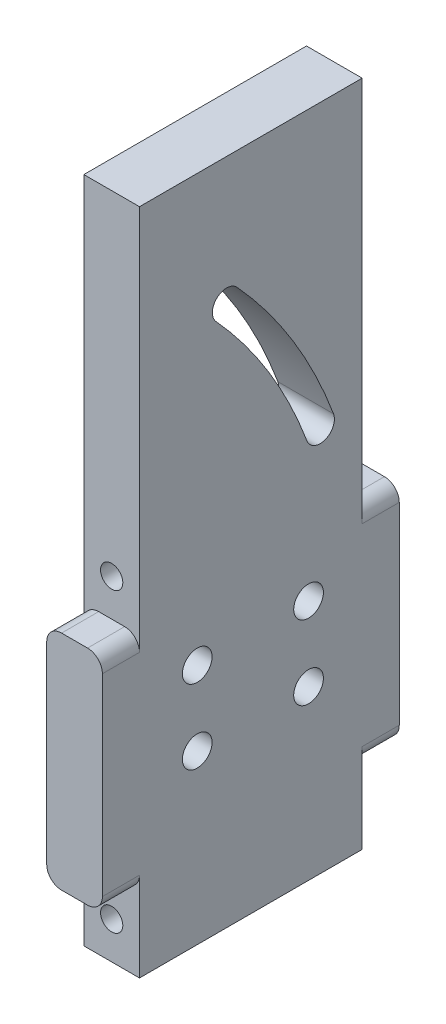
ISO-10303-21;
HEADER;
FILE_DESCRIPTION(('STEP AP214'),'2;1');
FILE_NAME('part.step','',(''),(''),'','','');
FILE_SCHEMA(('AUTOMOTIVE_DESIGN { 1 0 10303 214 1 1 1 1 }'));
ENDSEC;
DATA;
#1=APPLICATION_CONTEXT('core data for automotive mechanical design processes');
#2=APPLICATION_PROTOCOL_DEFINITION('international standard','automotive_design',2000,#1);
#3=PRODUCT_CONTEXT('',#1,'mechanical');
#4=PRODUCT('Part','Part','',(#3));
#5=PRODUCT_RELATED_PRODUCT_CATEGORY('part','',(#4));
#6=PRODUCT_DEFINITION_FORMATION('','',#4);
#7=PRODUCT_DEFINITION_CONTEXT('part definition',#1,'design');
#8=PRODUCT_DEFINITION('design','',#6,#7);
#9=PRODUCT_DEFINITION_SHAPE('','',#8);
#10=(LENGTH_UNIT() NAMED_UNIT(*) SI_UNIT(.MILLI.,.METRE.));
#11=(NAMED_UNIT(*) PLANE_ANGLE_UNIT() SI_UNIT($,.RADIAN.));
#12=(NAMED_UNIT(*) SI_UNIT($,.STERADIAN.) SOLID_ANGLE_UNIT());
#13=UNCERTAINTY_MEASURE_WITH_UNIT(LENGTH_MEASURE(1.E-05),#10,'distance_accuracy_value','');
#14=(GEOMETRIC_REPRESENTATION_CONTEXT(3) GLOBAL_UNCERTAINTY_ASSIGNED_CONTEXT((#13)) GLOBAL_UNIT_ASSIGNED_CONTEXT((#10,
#11,#12)) REPRESENTATION_CONTEXT('',''));
#15=CARTESIAN_POINT('',(0.,0.,0.));
#16=DIRECTION('',(0.,0.,1.));
#17=DIRECTION('',(1.,0.,0.));
#18=AXIS2_PLACEMENT_3D('',#15,#16,#17);
#19=CARTESIAN_POINT('',(19.05,0.,-76.2));
#20=DIRECTION('',(0.,1.,0.));
#21=DIRECTION('',(0.,0.,1.));
#22=AXIS2_PLACEMENT_3D('',#19,#20,#21);
#23=PLANE('',#22);
#24=DIRECTION('',(0.,0.,-1.));
#25=VECTOR('',#24,1.);
#26=CARTESIAN_POINT('',(0.,0.,-76.2));
#27=LINE('',#26,#25);
#28=CARTESIAN_POINT('',(0.,0.,0.));
#29=VERTEX_POINT('',#28);
#30=CARTESIAN_POINT('',(0.,0.,-76.2));
#31=VERTEX_POINT('',#30);
#32=EDGE_CURVE('E272',#29,#31,#27,.T.);
#33=ORIENTED_EDGE('',*,*,#32,.T.);
#34=DIRECTION('',(-1.,0.,0.));
#35=VECTOR('',#34,1.);
#36=CARTESIAN_POINT('',(19.05,0.,-76.2));
#37=LINE('',#36,#35);
#38=CARTESIAN_POINT('',(19.05,0.,-76.2));
#39=VERTEX_POINT('',#38);
#40=EDGE_CURVE('E342',#39,#31,#37,.T.);
#41=ORIENTED_EDGE('',*,*,#40,.F.);
#42=DIRECTION('',(0.,0.,-1.));
#43=VECTOR('',#42,1.);
#44=CARTESIAN_POINT('',(19.05,0.,-76.2));
#45=LINE('',#44,#43);
#46=CARTESIAN_POINT('',(19.05,0.,0.));
#47=VERTEX_POINT('',#46);
#48=EDGE_CURVE('E273',#47,#39,#45,.T.);
#49=ORIENTED_EDGE('',*,*,#48,.F.);
#50=DIRECTION('',(-1.,0.,0.));
#51=VECTOR('',#50,1.);
#52=CARTESIAN_POINT('',(19.05,0.,0.));
#53=LINE('',#52,#51);
#54=EDGE_CURVE('E293',#47,#29,#53,.T.);
#55=ORIENTED_EDGE('',*,*,#54,.T.);
#56=EDGE_LOOP('',(#33,#41,#49,#55));
#57=FACE_BOUND('',#56,.T.);
#58=ADVANCED_FACE('F32',(#57),#23,.F.);
#59=CARTESIAN_POINT('',(19.05,25.4,-76.2));
#60=DIRECTION('',(0.,0.,1.));
#61=DIRECTION('',(0.,-1.,0.));
#62=AXIS2_PLACEMENT_3D('',#59,#60,#61);
#63=PLANE('',#62);
#64=CARTESIAN_POINT('',(9.525,12.7,-76.2));
#65=DIRECTION('',(0.,0.,1.));
#66=DIRECTION('',(0.,-1.,0.));
#67=AXIS2_PLACEMENT_3D('',#64,#65,#66);
#68=CIRCLE('',#67,3.81);
#69=CARTESIAN_POINT('',(9.525,8.89,-76.2));
#70=VERTEX_POINT('',#69);
#71=EDGE_CURVE('E263',#70,#70,#68,.T.);
#72=ORIENTED_EDGE('',*,*,#71,.T.);
#73=EDGE_LOOP('',(#72));
#74=FACE_BOUND('',#73,.T.);
#75=DIRECTION('',(0.,1.,0.));
#76=VECTOR('',#75,1.);
#77=CARTESIAN_POINT('',(0.,25.4,-76.2));
#78=LINE('',#77,#76);
#79=CARTESIAN_POINT('',(0.,30.48,-76.2));
#80=VERTEX_POINT('',#79);
#81=EDGE_CURVE('E296',#31,#80,#78,.T.);
#82=ORIENTED_EDGE('',*,*,#81,.T.);
#83=CARTESIAN_POINT('',(5.08,30.48,-76.2));
#84=DIRECTION('',(0.,0.,1.));
#85=DIRECTION('',(0.,-1.,0.));
#86=AXIS2_PLACEMENT_3D('',#83,#84,#85);
#87=CIRCLE('',#86,5.08);
#88=CARTESIAN_POINT('',(5.08,25.4,-76.2));
#89=VERTEX_POINT('',#88);
#90=EDGE_CURVE('E410',#80,#89,#87,.T.);
#91=ORIENTED_EDGE('',*,*,#90,.T.);
#92=DIRECTION('',(-1.,0.,0.));
#93=VECTOR('',#92,1.);
#94=CARTESIAN_POINT('',(19.05,25.4,-76.2));
#95=LINE('',#94,#93);
#96=CARTESIAN_POINT('',(13.97,25.4,-76.2));
#97=VERTEX_POINT('',#96);
#98=EDGE_CURVE('E339',#97,#89,#95,.T.);
#99=ORIENTED_EDGE('',*,*,#98,.F.);
#100=CARTESIAN_POINT('',(13.97,30.48,-76.2));
#101=DIRECTION('',(0.,0.,1.));
#102=DIRECTION('',(0.,-1.,0.));
#103=AXIS2_PLACEMENT_3D('',#100,#101,#102);
#104=CIRCLE('',#103,5.08);
#105=CARTESIAN_POINT('',(19.05,30.48,-76.2));
#106=VERTEX_POINT('',#105);
#107=EDGE_CURVE('E402',#97,#106,#104,.T.);
#108=ORIENTED_EDGE('',*,*,#107,.T.);
#109=DIRECTION('',(0.,1.,0.));
#110=VECTOR('',#109,1.);
#111=CARTESIAN_POINT('',(19.05,25.4,-76.2));
#112=LINE('',#111,#110);
#113=EDGE_CURVE('E276',#39,#106,#112,.T.);
#114=ORIENTED_EDGE('',*,*,#113,.F.);
#115=ORIENTED_EDGE('',*,*,#40,.T.);
#116=EDGE_LOOP('',(#82,#91,#99,#108,#114,#115));
#117=FACE_BOUND('',#116,.T.);
#118=ADVANCED_FACE('F459',(#74,#117),#63,.F.);
#119=CARTESIAN_POINT('',(19.05,25.4,-88.9));
#120=DIRECTION('',(0.,1.,0.));
#121=DIRECTION('',(0.,0.,1.));
#122=AXIS2_PLACEMENT_3D('',#119,#120,#121);
#123=PLANE('',#122);
#124=DIRECTION('',(-1.,0.,0.));
#125=VECTOR('',#124,1.);
#126=CARTESIAN_POINT('',(19.05,25.4,-88.9));
#127=LINE('',#126,#125);
#128=CARTESIAN_POINT('',(13.97,25.4,-88.9));
#129=VERTEX_POINT('',#128);
#130=CARTESIAN_POINT('',(5.08,25.4,-88.9));
#131=VERTEX_POINT('',#130);
#132=EDGE_CURVE('E336',#129,#131,#127,.T.);
#133=ORIENTED_EDGE('',*,*,#132,.F.);
#134=DIRECTION('',(0.,0.,-1.));
#135=VECTOR('',#134,1.);
#136=CARTESIAN_POINT('',(13.97,25.4,-88.9));
#137=LINE('',#136,#135);
#138=EDGE_CURVE('E368',#129,#97,#137,.F.);
#139=ORIENTED_EDGE('',*,*,#138,.T.);
#140=ORIENTED_EDGE('',*,*,#98,.T.);
#141=DIRECTION('',(0.,0.,-1.));
#142=VECTOR('',#141,1.);
#143=CARTESIAN_POINT('',(5.08,25.4,-88.9));
#144=LINE('',#143,#142);
#145=EDGE_CURVE('E365',#89,#131,#144,.T.);
#146=ORIENTED_EDGE('',*,*,#145,.T.);
#147=EDGE_LOOP('',(#133,#139,#140,#146));
#148=FACE_BOUND('',#147,.T.);
#149=ADVANCED_FACE('F499',(#148),#123,.F.);
#150=CARTESIAN_POINT('',(19.05,101.6,-88.9));
#151=DIRECTION('',(0.,0.,1.));
#152=DIRECTION('',(0.,-1.,0.));
#153=AXIS2_PLACEMENT_3D('',#150,#151,#152);
#154=PLANE('',#153);
#155=DIRECTION('',(0.,1.,0.));
#156=VECTOR('',#155,1.);
#157=CARTESIAN_POINT('',(19.05,101.6,-88.9));
#158=LINE('',#157,#156);
#159=CARTESIAN_POINT('',(19.05,30.48,-88.9));
#160=VERTEX_POINT('',#159);
#161=CARTESIAN_POINT('',(19.05,96.52,-88.9));
#162=VERTEX_POINT('',#161);
#163=EDGE_CURVE('E279',#160,#162,#158,.T.);
#164=ORIENTED_EDGE('',*,*,#163,.F.);
#165=CARTESIAN_POINT('',(13.97,30.48,-88.9));
#166=DIRECTION('',(0.,0.,1.));
#167=DIRECTION('',(0.,-1.,0.));
#168=AXIS2_PLACEMENT_3D('',#165,#166,#167);
#169=CIRCLE('',#168,5.08);
#170=EDGE_CURVE('E363',#160,#129,#169,.F.);
#171=ORIENTED_EDGE('',*,*,#170,.T.);
#172=ORIENTED_EDGE('',*,*,#132,.T.);
#173=CARTESIAN_POINT('',(5.08,30.48,-88.9));
#174=DIRECTION('',(0.,0.,1.));
#175=DIRECTION('',(0.,-1.,0.));
#176=AXIS2_PLACEMENT_3D('',#173,#174,#175);
#177=CIRCLE('',#176,5.08);
#178=CARTESIAN_POINT('',(0.,30.48,-88.9));
#179=VERTEX_POINT('',#178);
#180=EDGE_CURVE('E357',#131,#179,#177,.F.);
#181=ORIENTED_EDGE('',*,*,#180,.T.);
#182=DIRECTION('',(0.,1.,0.));
#183=VECTOR('',#182,1.);
#184=CARTESIAN_POINT('',(0.,101.6,-88.9));
#185=LINE('',#184,#183);
#186=CARTESIAN_POINT('',(0.,96.52,-88.9));
#187=VERTEX_POINT('',#186);
#188=EDGE_CURVE('E298',#179,#187,#185,.T.);
#189=ORIENTED_EDGE('',*,*,#188,.T.);
#190=CARTESIAN_POINT('',(5.08,96.52,-88.9));
#191=DIRECTION('',(0.,0.,1.));
#192=DIRECTION('',(0.,-1.,0.));
#193=AXIS2_PLACEMENT_3D('',#190,#191,#192);
#194=CIRCLE('',#193,5.08);
#195=CARTESIAN_POINT('',(5.08,101.6,-88.9));
#196=VERTEX_POINT('',#195);
#197=EDGE_CURVE('E359',#187,#196,#194,.F.);
#198=ORIENTED_EDGE('',*,*,#197,.T.);
#199=DIRECTION('',(-1.,0.,0.));
#200=VECTOR('',#199,1.);
#201=CARTESIAN_POINT('',(19.05,101.6,-88.9));
#202=LINE('',#201,#200);
#203=CARTESIAN_POINT('',(13.97,101.6,-88.9));
#204=VERTEX_POINT('',#203);
#205=EDGE_CURVE('E333',#204,#196,#202,.T.);
#206=ORIENTED_EDGE('',*,*,#205,.F.);
#207=CARTESIAN_POINT('',(13.97,96.52,-88.9));
#208=DIRECTION('',(0.,0.,1.));
#209=DIRECTION('',(0.,-1.,0.));
#210=AXIS2_PLACEMENT_3D('',#207,#208,#209);
#211=CIRCLE('',#210,5.08);
#212=EDGE_CURVE('E361',#204,#162,#211,.F.);
#213=ORIENTED_EDGE('',*,*,#212,.T.);
#214=EDGE_LOOP('',(#164,#171,#172,#181,#189,#198,#206,#213));
#215=FACE_BOUND('',#214,.T.);
#216=ADVANCED_FACE('F467',(#215),#154,.F.);
#217=CARTESIAN_POINT('',(19.05,101.6,-76.2));
#218=DIRECTION('',(0.,-1.,0.));
#219=DIRECTION('',(0.,0.,-1.));
#220=AXIS2_PLACEMENT_3D('',#217,#218,#219);
#221=PLANE('',#220);
#222=DIRECTION('',(-1.,0.,0.));
#223=VECTOR('',#222,1.);
#224=CARTESIAN_POINT('',(19.05,101.6,-76.2));
#225=LINE('',#224,#223);
#226=CARTESIAN_POINT('',(13.97,101.6,-76.2));
#227=VERTEX_POINT('',#226);
#228=CARTESIAN_POINT('',(5.08,101.6,-76.2));
#229=VERTEX_POINT('',#228);
#230=EDGE_CURVE('E330',#227,#229,#225,.T.);
#231=ORIENTED_EDGE('',*,*,#230,.F.);
#232=DIRECTION('',(0.,0.,1.));
#233=VECTOR('',#232,1.);
#234=CARTESIAN_POINT('',(13.97,101.6,-76.2));
#235=LINE('',#234,#233);
#236=EDGE_CURVE('E373',#227,#204,#235,.F.);
#237=ORIENTED_EDGE('',*,*,#236,.T.);
#238=ORIENTED_EDGE('',*,*,#205,.T.);
#239=DIRECTION('',(0.,0.,1.));
#240=VECTOR('',#239,1.);
#241=CARTESIAN_POINT('',(5.08,101.6,-76.2));
#242=LINE('',#241,#240);
#243=EDGE_CURVE('E370',#196,#229,#242,.T.);
#244=ORIENTED_EDGE('',*,*,#243,.T.);
#245=EDGE_LOOP('',(#231,#237,#238,#244));
#246=FACE_BOUND('',#245,.T.);
#247=ADVANCED_FACE('F633',(#246),#221,.F.);
#248=CARTESIAN_POINT('',(19.05,228.6,-76.2));
#249=DIRECTION('',(0.,0.,1.));
#250=DIRECTION('',(0.,-1.,0.));
#251=AXIS2_PLACEMENT_3D('',#248,#249,#250);
#252=PLANE('',#251);
#253=CARTESIAN_POINT('',(9.525,114.3,-76.2));
#254=DIRECTION('',(0.,0.,1.));
#255=DIRECTION('',(0.,-1.,0.));
#256=AXIS2_PLACEMENT_3D('',#253,#254,#255);
#257=CIRCLE('',#256,3.81);
#258=CARTESIAN_POINT('',(9.525,110.49,-76.2));
#259=VERTEX_POINT('',#258);
#260=EDGE_CURVE('E269',#259,#259,#257,.T.);
#261=ORIENTED_EDGE('',*,*,#260,.T.);
#262=EDGE_LOOP('',(#261));
#263=FACE_BOUND('',#262,.T.);
#264=DIRECTION('',(0.,1.,0.));
#265=VECTOR('',#264,1.);
#266=CARTESIAN_POINT('',(0.,228.6,-76.2));
#267=LINE('',#266,#265);
#268=CARTESIAN_POINT('',(0.,96.52,-76.2));
#269=VERTEX_POINT('',#268);
#270=CARTESIAN_POINT('',(0.,228.6,-76.2));
#271=VERTEX_POINT('',#270);
#272=EDGE_CURVE('E301',#269,#271,#267,.T.);
#273=ORIENTED_EDGE('',*,*,#272,.T.);
#274=DIRECTION('',(-1.,0.,0.));
#275=VECTOR('',#274,1.);
#276=CARTESIAN_POINT('',(19.05,228.6,-76.2));
#277=LINE('',#276,#275);
#278=CARTESIAN_POINT('',(19.05,228.6,-76.2));
#279=VERTEX_POINT('',#278);
#280=EDGE_CURVE('E327',#279,#271,#277,.T.);
#281=ORIENTED_EDGE('',*,*,#280,.F.);
#282=DIRECTION('',(0.,1.,0.));
#283=VECTOR('',#282,1.);
#284=CARTESIAN_POINT('',(19.05,228.6,-76.2));
#285=LINE('',#284,#283);
#286=CARTESIAN_POINT('',(19.05,96.52,-76.2));
#287=VERTEX_POINT('',#286);
#288=EDGE_CURVE('E282',#287,#279,#285,.T.);
#289=ORIENTED_EDGE('',*,*,#288,.F.);
#290=CARTESIAN_POINT('',(13.97,96.52,-76.2));
#291=DIRECTION('',(0.,0.,1.));
#292=DIRECTION('',(0.,-1.,0.));
#293=AXIS2_PLACEMENT_3D('',#290,#291,#292);
#294=CIRCLE('',#293,5.08);
#295=EDGE_CURVE('E405',#287,#227,#294,.T.);
#296=ORIENTED_EDGE('',*,*,#295,.T.);
#297=ORIENTED_EDGE('',*,*,#230,.T.);
#298=CARTESIAN_POINT('',(5.08,96.52,-76.2));
#299=DIRECTION('',(0.,0.,1.));
#300=DIRECTION('',(0.,-1.,0.));
#301=AXIS2_PLACEMENT_3D('',#298,#299,#300);
#302=CIRCLE('',#301,5.08);
#303=EDGE_CURVE('E407',#229,#269,#302,.T.);
#304=ORIENTED_EDGE('',*,*,#303,.T.);
#305=EDGE_LOOP('',(#273,#281,#289,#296,#297,#304));
#306=FACE_BOUND('',#305,.T.);
#307=ADVANCED_FACE('F479',(#263,#306),#252,.F.);
#308=CARTESIAN_POINT('',(19.05,228.6,0.));
#309=DIRECTION('',(0.,-1.,0.));
#310=DIRECTION('',(0.,0.,-1.));
#311=AXIS2_PLACEMENT_3D('',#308,#309,#310);
#312=PLANE('',#311);
#313=DIRECTION('',(0.,0.,1.));
#314=VECTOR('',#313,1.);
#315=CARTESIAN_POINT('',(0.,228.6,0.));
#316=LINE('',#315,#314);
#317=CARTESIAN_POINT('',(0.,228.6,0.));
#318=VERTEX_POINT('',#317);
#319=EDGE_CURVE('E303',#271,#318,#316,.T.);
#320=ORIENTED_EDGE('',*,*,#319,.T.);
#321=DIRECTION('',(-1.,0.,0.));
#322=VECTOR('',#321,1.);
#323=CARTESIAN_POINT('',(19.05,228.6,0.));
#324=LINE('',#323,#322);
#325=CARTESIAN_POINT('',(19.05,228.6,0.));
#326=VERTEX_POINT('',#325);
#327=EDGE_CURVE('E324',#326,#318,#324,.T.);
#328=ORIENTED_EDGE('',*,*,#327,.F.);
#329=DIRECTION('',(0.,0.,1.));
#330=VECTOR('',#329,1.);
#331=CARTESIAN_POINT('',(19.05,228.6,0.));
#332=LINE('',#331,#330);
#333=EDGE_CURVE('E284',#279,#326,#332,.T.);
#334=ORIENTED_EDGE('',*,*,#333,.F.);
#335=ORIENTED_EDGE('',*,*,#280,.T.);
#336=EDGE_LOOP('',(#320,#328,#334,#335));
#337=FACE_BOUND('',#336,.T.);
#338=ADVANCED_FACE('F482',(#337),#312,.F.);
#339=CARTESIAN_POINT('',(19.05,101.6,0.));
#340=DIRECTION('',(0.,0.,-1.));
#341=DIRECTION('',(-1.,0.,0.));
#342=AXIS2_PLACEMENT_3D('',#339,#340,#341);
#343=PLANE('',#342);
#344=CARTESIAN_POINT('',(9.525,114.3,0.));
#345=DIRECTION('',(0.,0.,1.));
#346=DIRECTION('',(1.,0.,0.));
#347=AXIS2_PLACEMENT_3D('',#344,#345,#346);
#348=CIRCLE('',#347,3.81);
#349=CARTESIAN_POINT('',(13.335,114.3,0.));
#350=VERTEX_POINT('',#349);
#351=EDGE_CURVE('E266',#350,#350,#348,.T.);
#352=ORIENTED_EDGE('',*,*,#351,.F.);
#353=EDGE_LOOP('',(#352));
#354=FACE_BOUND('',#353,.T.);
#355=DIRECTION('',(0.,-1.,0.));
#356=VECTOR('',#355,1.);
#357=CARTESIAN_POINT('',(0.,101.6,0.));
#358=LINE('',#357,#356);
#359=CARTESIAN_POINT('',(0.,96.52,0.));
#360=VERTEX_POINT('',#359);
#361=EDGE_CURVE('E305',#318,#360,#358,.T.);
#362=ORIENTED_EDGE('',*,*,#361,.T.);
#363=CARTESIAN_POINT('',(5.08,96.52,0.));
#364=DIRECTION('',(0.,0.,-1.));
#365=DIRECTION('',(-1.,0.,0.));
#366=AXIS2_PLACEMENT_3D('',#363,#364,#365);
#367=CIRCLE('',#366,5.08);
#368=CARTESIAN_POINT('',(5.08,101.6,0.));
#369=VERTEX_POINT('',#368);
#370=EDGE_CURVE('E40',#360,#369,#367,.T.);
#371=ORIENTED_EDGE('',*,*,#370,.T.);
#372=DIRECTION('',(-1.,0.,0.));
#373=VECTOR('',#372,1.);
#374=CARTESIAN_POINT('',(19.05,101.6,0.));
#375=LINE('',#374,#373);
#376=CARTESIAN_POINT('',(13.97,101.6,0.));
#377=VERTEX_POINT('',#376);
#378=EDGE_CURVE('E322',#377,#369,#375,.T.);
#379=ORIENTED_EDGE('',*,*,#378,.F.);
#380=CARTESIAN_POINT('',(13.97,96.52,0.));
#381=DIRECTION('',(0.,0.,-1.));
#382=DIRECTION('',(-1.,0.,0.));
#383=AXIS2_PLACEMENT_3D('',#380,#381,#382);
#384=CIRCLE('',#383,5.08);
#385=CARTESIAN_POINT('',(19.05,96.52,0.));
#386=VERTEX_POINT('',#385);
#387=EDGE_CURVE('E11',#377,#386,#384,.T.);
#388=ORIENTED_EDGE('',*,*,#387,.T.);
#389=DIRECTION('',(0.,-1.,0.));
#390=VECTOR('',#389,1.);
#391=CARTESIAN_POINT('',(19.05,101.6,0.));
#392=LINE('',#391,#390);
#393=EDGE_CURVE('E286',#326,#386,#392,.T.);
#394=ORIENTED_EDGE('',*,*,#393,.F.);
#395=ORIENTED_EDGE('',*,*,#327,.T.);
#396=EDGE_LOOP('',(#362,#371,#379,#388,#394,#395));
#397=FACE_BOUND('',#396,.T.);
#398=ADVANCED_FACE('F483',(#354,#397),#343,.F.);
#399=CARTESIAN_POINT('',(19.05,101.6,12.7));
#400=DIRECTION('',(0.,-1.,0.));
#401=DIRECTION('',(0.,0.,-1.));
#402=AXIS2_PLACEMENT_3D('',#399,#400,#401);
#403=PLANE('',#402);
#404=ORIENTED_EDGE('',*,*,#378,.T.);
#405=DIRECTION('',(0.,0.,1.));
#406=VECTOR('',#405,1.);
#407=CARTESIAN_POINT('',(5.08,101.6,12.7));
#408=LINE('',#407,#406);
#409=CARTESIAN_POINT('',(5.08,101.6,12.7));
#410=VERTEX_POINT('',#409);
#411=EDGE_CURVE('E399',#369,#410,#408,.T.);
#412=ORIENTED_EDGE('',*,*,#411,.T.);
#413=DIRECTION('',(-1.,0.,0.));
#414=VECTOR('',#413,1.);
#415=CARTESIAN_POINT('',(19.05,101.6,12.7));
#416=LINE('',#415,#414);
#417=CARTESIAN_POINT('',(13.97,101.6,12.7));
#418=VERTEX_POINT('',#417);
#419=EDGE_CURVE('E319',#418,#410,#416,.T.);
#420=ORIENTED_EDGE('',*,*,#419,.F.);
#421=DIRECTION('',(0.,0.,1.));
#422=VECTOR('',#421,1.);
#423=CARTESIAN_POINT('',(13.97,101.6,12.7));
#424=LINE('',#423,#422);
#425=EDGE_CURVE('E53',#418,#377,#424,.F.);
#426=ORIENTED_EDGE('',*,*,#425,.T.);
#427=EDGE_LOOP('',(#404,#412,#420,#426));
#428=FACE_BOUND('',#427,.T.);
#429=ADVANCED_FACE('F439',(#428),#403,.F.);
#430=CARTESIAN_POINT('',(19.05,25.4,12.7));
#431=DIRECTION('',(0.,0.,-1.));
#432=DIRECTION('',(-1.,0.,0.));
#433=AXIS2_PLACEMENT_3D('',#430,#431,#432);
#434=PLANE('',#433);
#435=DIRECTION('',(0.,-1.,0.));
#436=VECTOR('',#435,1.);
#437=CARTESIAN_POINT('',(0.,25.4,12.7));
#438=LINE('',#437,#436);
#439=CARTESIAN_POINT('',(0.,96.52,12.7));
#440=VERTEX_POINT('',#439);
#441=CARTESIAN_POINT('',(0.,30.48,12.7));
#442=VERTEX_POINT('',#441);
#443=EDGE_CURVE('E307',#440,#442,#438,.T.);
#444=ORIENTED_EDGE('',*,*,#443,.T.);
#445=CARTESIAN_POINT('',(5.08,30.48,12.7));
#446=DIRECTION('',(0.,0.,-1.));
#447=DIRECTION('',(-1.,0.,0.));
#448=AXIS2_PLACEMENT_3D('',#445,#446,#447);
#449=CIRCLE('',#448,5.08);
#450=CARTESIAN_POINT('',(5.08,25.4,12.7));
#451=VERTEX_POINT('',#450);
#452=EDGE_CURVE('E396',#442,#451,#449,.F.);
#453=ORIENTED_EDGE('',*,*,#452,.T.);
#454=DIRECTION('',(-1.,0.,0.));
#455=VECTOR('',#454,1.);
#456=CARTESIAN_POINT('',(19.05,25.4,12.7));
#457=LINE('',#456,#455);
#458=CARTESIAN_POINT('',(13.97,25.4,12.7));
#459=VERTEX_POINT('',#458);
#460=EDGE_CURVE('E316',#459,#451,#457,.T.);
#461=ORIENTED_EDGE('',*,*,#460,.F.);
#462=CARTESIAN_POINT('',(13.97,30.48,12.7));
#463=DIRECTION('',(0.,0.,-1.));
#464=DIRECTION('',(-1.,0.,0.));
#465=AXIS2_PLACEMENT_3D('',#462,#463,#464);
#466=CIRCLE('',#465,5.08);
#467=CARTESIAN_POINT('',(19.05,30.48,12.7));
#468=VERTEX_POINT('',#467);
#469=EDGE_CURVE('E394',#459,#468,#466,.F.);
#470=ORIENTED_EDGE('',*,*,#469,.T.);
#471=DIRECTION('',(0.,-1.,0.));
#472=VECTOR('',#471,1.);
#473=CARTESIAN_POINT('',(19.05,25.4,12.7));
#474=LINE('',#473,#472);
#475=CARTESIAN_POINT('',(19.05,96.52,12.7));
#476=VERTEX_POINT('',#475);
#477=EDGE_CURVE('E288',#476,#468,#474,.T.);
#478=ORIENTED_EDGE('',*,*,#477,.F.);
#479=CARTESIAN_POINT('',(13.97,96.52,12.7));
#480=DIRECTION('',(0.,0.,-1.));
#481=DIRECTION('',(-1.,0.,0.));
#482=AXIS2_PLACEMENT_3D('',#479,#480,#481);
#483=CIRCLE('',#482,5.08);
#484=EDGE_CURVE('E390',#476,#418,#483,.F.);
#485=ORIENTED_EDGE('',*,*,#484,.T.);
#486=ORIENTED_EDGE('',*,*,#419,.T.);
#487=CARTESIAN_POINT('',(5.08,96.52,12.7));
#488=DIRECTION('',(0.,0.,-1.));
#489=DIRECTION('',(-1.,0.,0.));
#490=AXIS2_PLACEMENT_3D('',#487,#488,#489);
#491=CIRCLE('',#490,5.08);
#492=EDGE_CURVE('E392',#410,#440,#491,.F.);
#493=ORIENTED_EDGE('',*,*,#492,.T.);
#494=EDGE_LOOP('',(#444,#453,#461,#470,#478,#485,#486,#493));
#495=FACE_BOUND('',#494,.T.);
#496=ADVANCED_FACE('F432',(#495),#434,.F.);
#497=CARTESIAN_POINT('',(19.05,25.4,0.));
#498=DIRECTION('',(0.,1.,0.));
#499=DIRECTION('',(0.,0.,1.));
#500=AXIS2_PLACEMENT_3D('',#497,#498,#499);
#501=PLANE('',#500);
#502=ORIENTED_EDGE('',*,*,#460,.T.);
#503=DIRECTION('',(0.,0.,-1.));
#504=VECTOR('',#503,1.);
#505=CARTESIAN_POINT('',(5.08,25.4,0.));
#506=LINE('',#505,#504);
#507=CARTESIAN_POINT('',(5.08,25.4,0.));
#508=VERTEX_POINT('',#507);
#509=EDGE_CURVE('E387',#451,#508,#506,.T.);
#510=ORIENTED_EDGE('',*,*,#509,.T.);
#511=DIRECTION('',(-1.,0.,0.));
#512=VECTOR('',#511,1.);
#513=CARTESIAN_POINT('',(19.05,25.4,0.));
#514=LINE('',#513,#512);
#515=CARTESIAN_POINT('',(13.97,25.4,0.));
#516=VERTEX_POINT('',#515);
#517=EDGE_CURVE('E313',#516,#508,#514,.T.);
#518=ORIENTED_EDGE('',*,*,#517,.F.);
#519=DIRECTION('',(0.,0.,-1.));
#520=VECTOR('',#519,1.);
#521=CARTESIAN_POINT('',(13.97,25.4,0.));
#522=LINE('',#521,#520);
#523=EDGE_CURVE('E385',#516,#459,#522,.F.);
#524=ORIENTED_EDGE('',*,*,#523,.T.);
#525=EDGE_LOOP('',(#502,#510,#518,#524));
#526=FACE_BOUND('',#525,.T.);
#527=ADVANCED_FACE('F425',(#526),#501,.F.);
#528=CARTESIAN_POINT('',(19.05,0.,0.));
#529=DIRECTION('',(0.,0.,-1.));
#530=DIRECTION('',(-1.,0.,0.));
#531=AXIS2_PLACEMENT_3D('',#528,#529,#530);
#532=PLANE('',#531);
#533=CARTESIAN_POINT('',(9.525,12.7,0.));
#534=DIRECTION('',(0.,0.,1.));
#535=DIRECTION('',(1.,0.,0.));
#536=AXIS2_PLACEMENT_3D('',#533,#534,#535);
#537=CIRCLE('',#536,3.81);
#538=CARTESIAN_POINT('',(13.335,12.7,0.));
#539=VERTEX_POINT('',#538);
#540=EDGE_CURVE('E258',#539,#539,#537,.T.);
#541=ORIENTED_EDGE('',*,*,#540,.F.);
#542=EDGE_LOOP('',(#541));
#543=FACE_BOUND('',#542,.T.);
#544=DIRECTION('',(0.,-1.,0.));
#545=VECTOR('',#544,1.);
#546=CARTESIAN_POINT('',(0.,0.,0.));
#547=LINE('',#546,#545);
#548=CARTESIAN_POINT('',(0.,30.48,0.));
#549=VERTEX_POINT('',#548);
#550=EDGE_CURVE('E277',#549,#29,#547,.T.);
#551=ORIENTED_EDGE('',*,*,#550,.T.);
#552=ORIENTED_EDGE('',*,*,#54,.F.);
#553=DIRECTION('',(0.,-1.,0.));
#554=VECTOR('',#553,1.);
#555=CARTESIAN_POINT('',(19.05,0.,0.));
#556=LINE('',#555,#554);
#557=CARTESIAN_POINT('',(19.05,30.48,0.));
#558=VERTEX_POINT('',#557);
#559=EDGE_CURVE('E291',#558,#47,#556,.T.);
#560=ORIENTED_EDGE('',*,*,#559,.F.);
#561=CARTESIAN_POINT('',(13.97,30.48,0.));
#562=DIRECTION('',(0.,0.,-1.));
#563=DIRECTION('',(-1.,0.,0.));
#564=AXIS2_PLACEMENT_3D('',#561,#562,#563);
#565=CIRCLE('',#564,5.08);
#566=EDGE_CURVE('E415',#558,#516,#565,.T.);
#567=ORIENTED_EDGE('',*,*,#566,.T.);
#568=ORIENTED_EDGE('',*,*,#517,.T.);
#569=CARTESIAN_POINT('',(5.08,30.48,0.));
#570=DIRECTION('',(0.,0.,-1.));
#571=DIRECTION('',(-1.,0.,0.));
#572=AXIS2_PLACEMENT_3D('',#569,#570,#571);
#573=CIRCLE('',#572,5.08);
#574=EDGE_CURVE('E412',#508,#549,#573,.T.);
#575=ORIENTED_EDGE('',*,*,#574,.T.);
#576=EDGE_LOOP('',(#551,#552,#560,#567,#568,#575));
#577=FACE_BOUND('',#576,.T.);
#578=ADVANCED_FACE('F419',(#543,#577),#532,.F.);
#579=CARTESIAN_POINT('',(19.05,0.,0.));
#580=DIRECTION('',(-1.,0.,0.));
#581=DIRECTION('',(0.,0.,1.));
#582=AXIS2_PLACEMENT_3D('',#579,#580,#581);
#583=PLANE('',#582);
#584=CARTESIAN_POINT('',(19.05,76.2,88.9));
#585=DIRECTION('',(1.,0.,0.));
#586=DIRECTION('',(0.,0.,-1.));
#587=AXIS2_PLACEMENT_3D('',#584,#585,#586);
#588=CIRCLE('',#587,165.706551754291);
#589=CARTESIAN_POINT('',(19.05,134.02727708313,-66.3889800322244));
#590=VERTEX_POINT('',#589);
#591=CARTESIAN_POINT('',(19.05,188.013677286595,-33.3962095322128));
#592=VERTEX_POINT('',#591);
#593=EDGE_CURVE('E227',#590,#592,#588,.T.);
#594=ORIENTED_EDGE('',*,*,#593,.F.);
#595=CARTESIAN_POINT('',(19.05,132.32800019087,-61.8257533215485));
#596=DIRECTION('',(1.,0.,0.));
#597=DIRECTION('',(0.,0.,-1.));
#598=AXIS2_PLACEMENT_3D('',#595,#596,#597);
#599=CIRCLE('',#598,4.86935108300831);
#600=CARTESIAN_POINT('',(19.05,130.62872329861,-57.2625266108727));
#601=VERTEX_POINT('',#600);
#602=EDGE_CURVE('E200',#601,#590,#599,.T.);
#603=ORIENTED_EDGE('',*,*,#602,.F.);
#604=CARTESIAN_POINT('',(19.05,76.2,88.9));
#605=DIRECTION('',(-1.,0.,0.));
#606=DIRECTION('',(0.,0.,-1.));
#607=AXIS2_PLACEMENT_3D('',#604,#605,#606);
#608=CIRCLE('',#607,155.967849588275);
#609=CARTESIAN_POINT('',(19.05,181.442301021425,-26.2087667421836));
#610=VERTEX_POINT('',#609);
#611=EDGE_CURVE('E218',#610,#601,#608,.T.);
#612=ORIENTED_EDGE('',*,*,#611,.F.);
#613=CARTESIAN_POINT('',(19.05,184.72798915401,-29.8024881371983));
#614=DIRECTION('',(1.,0.,0.));
#615=DIRECTION('',(0.,0.,-1.));
#616=AXIS2_PLACEMENT_3D('',#613,#614,#615);
#617=CIRCLE('',#616,4.86935108300831);
#618=EDGE_CURVE('E221',#592,#610,#617,.T.);
#619=ORIENTED_EDGE('',*,*,#618,.F.);
#620=EDGE_LOOP('',(#594,#603,#612,#619));
#621=FACE_BOUND('',#620,.T.);
#622=CARTESIAN_POINT('',(19.05,82.8153011394466,-57.8550700151602));
#623=DIRECTION('',(1.,0.,0.));
#624=DIRECTION('',(0.,0.,-1.));
#625=AXIS2_PLACEMENT_3D('',#622,#623,#624);
#626=CIRCLE('',#625,5.08000000000001);
#627=CARTESIAN_POINT('',(19.05,82.8153011394466,-62.9350700151602));
#628=VERTEX_POINT('',#627);
#629=EDGE_CURVE('E233',#628,#628,#626,.T.);
#630=ORIENTED_EDGE('',*,*,#629,.F.);
#631=EDGE_LOOP('',(#630));
#632=FACE_BOUND('',#631,.T.);
#633=CARTESIAN_POINT('',(19.05,82.8153011394466,-19.7550700151602));
#634=DIRECTION('',(1.,0.,0.));
#635=DIRECTION('',(0.,0.,-1.));
#636=AXIS2_PLACEMENT_3D('',#633,#634,#635);
#637=CIRCLE('',#636,5.08000000000001);
#638=CARTESIAN_POINT('',(19.05,82.8153011394466,-24.8350700151602));
#639=VERTEX_POINT('',#638);
#640=EDGE_CURVE('E240',#639,#639,#637,.T.);
#641=ORIENTED_EDGE('',*,*,#640,.F.);
#642=EDGE_LOOP('',(#641));
#643=FACE_BOUND('',#642,.T.);
#644=CARTESIAN_POINT('',(19.05,57.4153011394466,-57.8550700151603));
#645=DIRECTION('',(1.,0.,0.));
#646=DIRECTION('',(0.,0.,-1.));
#647=AXIS2_PLACEMENT_3D('',#644,#645,#646);
#648=CIRCLE('',#647,5.08);
#649=CARTESIAN_POINT('',(19.05,57.4153011394466,-62.9350700151603));
#650=VERTEX_POINT('',#649);
#651=EDGE_CURVE('E246',#650,#650,#648,.T.);
#652=ORIENTED_EDGE('',*,*,#651,.F.);
#653=EDGE_LOOP('',(#652));
#654=FACE_BOUND('',#653,.T.);
#655=CARTESIAN_POINT('',(19.05,57.4153011394466,-19.7550700151603));
#656=DIRECTION('',(1.,0.,0.));
#657=DIRECTION('',(0.,0.,-1.));
#658=AXIS2_PLACEMENT_3D('',#655,#656,#657);
#659=CIRCLE('',#658,5.08);
#660=CARTESIAN_POINT('',(19.05,57.4153011394466,-24.8350700151603));
#661=VERTEX_POINT('',#660);
#662=EDGE_CURVE('E252',#661,#661,#659,.T.);
#663=ORIENTED_EDGE('',*,*,#662,.F.);
#664=EDGE_LOOP('',(#663));
#665=FACE_BOUND('',#664,.T.);
#666=ORIENTED_EDGE('',*,*,#113,.T.);
#667=DIRECTION('',(0.,0.,-1.));
#668=VECTOR('',#667,1.);
#669=CARTESIAN_POINT('',(19.05,30.48,0.));
#670=LINE('',#669,#668);
#671=EDGE_CURVE('E354',#106,#160,#670,.T.);
#672=ORIENTED_EDGE('',*,*,#671,.T.);
#673=ORIENTED_EDGE('',*,*,#163,.T.);
#674=DIRECTION('',(0.,0.,1.));
#675=VECTOR('',#674,1.);
#676=CARTESIAN_POINT('',(19.05,96.52,0.));
#677=LINE('',#676,#675);
#678=EDGE_CURVE('E351',#162,#287,#677,.T.);
#679=ORIENTED_EDGE('',*,*,#678,.T.);
#680=ORIENTED_EDGE('',*,*,#288,.T.);
#681=ORIENTED_EDGE('',*,*,#333,.T.);
#682=ORIENTED_EDGE('',*,*,#393,.T.);
#683=DIRECTION('',(0.,0.,1.));
#684=VECTOR('',#683,1.);
#685=CARTESIAN_POINT('',(19.05,96.52,0.));
#686=LINE('',#685,#684);
#687=EDGE_CURVE('E345',#386,#476,#686,.T.);
#688=ORIENTED_EDGE('',*,*,#687,.T.);
#689=ORIENTED_EDGE('',*,*,#477,.T.);
#690=DIRECTION('',(0.,0.,-1.));
#691=VECTOR('',#690,1.);
#692=CARTESIAN_POINT('',(19.05,30.48,0.));
#693=LINE('',#692,#691);
#694=EDGE_CURVE('E348',#468,#558,#693,.T.);
#695=ORIENTED_EDGE('',*,*,#694,.T.);
#696=ORIENTED_EDGE('',*,*,#559,.T.);
#697=ORIENTED_EDGE('',*,*,#48,.T.);
#698=EDGE_LOOP('',(#666,#672,#673,#679,#680,#681,#682,#688,#689,#695,#696,#697));
#699=FACE_BOUND('',#698,.T.);
#700=ADVANCED_FACE('F434',(#621,#632,#643,#654,#665,#699),#583,.F.);
#701=CARTESIAN_POINT('',(0.,0.,0.));
#702=DIRECTION('',(-1.,0.,0.));
#703=DIRECTION('',(0.,0.,1.));
#704=AXIS2_PLACEMENT_3D('',#701,#702,#703);
#705=PLANE('',#704);
#706=CARTESIAN_POINT('',(0.,132.32800019087,-61.8257533215485));
#707=DIRECTION('',(1.,0.,0.));
#708=DIRECTION('',(0.,0.,-1.));
#709=AXIS2_PLACEMENT_3D('',#706,#707,#708);
#710=CIRCLE('',#709,4.86935108300831);
#711=CARTESIAN_POINT('',(0.,130.62872329861,-57.2625266108727));
#712=VERTEX_POINT('',#711);
#713=CARTESIAN_POINT('',(0.,134.02727708313,-66.3889800322244));
#714=VERTEX_POINT('',#713);
#715=EDGE_CURVE('E197',#712,#714,#710,.T.);
#716=ORIENTED_EDGE('',*,*,#715,.T.);
#717=CARTESIAN_POINT('',(0.,76.2,88.9));
#718=DIRECTION('',(1.,0.,0.));
#719=DIRECTION('',(0.,0.,-1.));
#720=AXIS2_PLACEMENT_3D('',#717,#718,#719);
#721=CIRCLE('',#720,165.706551754291);
#722=CARTESIAN_POINT('',(0.,188.013677286595,-33.3962095322128));
#723=VERTEX_POINT('',#722);
#724=EDGE_CURVE('E209',#714,#723,#721,.T.);
#725=ORIENTED_EDGE('',*,*,#724,.T.);
#726=CARTESIAN_POINT('',(0.,184.72798915401,-29.8024881371983));
#727=DIRECTION('',(1.,0.,0.));
#728=DIRECTION('',(0.,0.,-1.));
#729=AXIS2_PLACEMENT_3D('',#726,#727,#728);
#730=CIRCLE('',#729,4.86935108300831);
#731=CARTESIAN_POINT('',(0.,181.442301021425,-26.2087667421836));
#732=VERTEX_POINT('',#731);
#733=EDGE_CURVE('E213',#723,#732,#730,.T.);
#734=ORIENTED_EDGE('',*,*,#733,.T.);
#735=CARTESIAN_POINT('',(0.,76.2,88.9));
#736=DIRECTION('',(-1.,0.,0.));
#737=DIRECTION('',(0.,0.,-1.));
#738=AXIS2_PLACEMENT_3D('',#735,#736,#737);
#739=CIRCLE('',#738,155.967849588275);
#740=EDGE_CURVE('E205',#732,#712,#739,.T.);
#741=ORIENTED_EDGE('',*,*,#740,.T.);
#742=EDGE_LOOP('',(#716,#725,#734,#741));
#743=FACE_BOUND('',#742,.T.);
#744=CARTESIAN_POINT('',(0.,82.8153011394466,-57.8550700151602));
#745=DIRECTION('',(1.,0.,0.));
#746=DIRECTION('',(0.,0.,-1.));
#747=AXIS2_PLACEMENT_3D('',#744,#745,#746);
#748=CIRCLE('',#747,5.08000000000001);
#749=CARTESIAN_POINT('',(0.,82.8153011394466,-62.9350700151602));
#750=VERTEX_POINT('',#749);
#751=EDGE_CURVE('E237',#750,#750,#748,.T.);
#752=ORIENTED_EDGE('',*,*,#751,.T.);
#753=EDGE_LOOP('',(#752));
#754=FACE_BOUND('',#753,.T.);
#755=CARTESIAN_POINT('',(0.,82.8153011394466,-19.7550700151602));
#756=DIRECTION('',(1.,0.,0.));
#757=DIRECTION('',(0.,0.,-1.));
#758=AXIS2_PLACEMENT_3D('',#755,#756,#757);
#759=CIRCLE('',#758,5.08000000000001);
#760=CARTESIAN_POINT('',(0.,82.8153011394466,-24.8350700151602));
#761=VERTEX_POINT('',#760);
#762=EDGE_CURVE('E243',#761,#761,#759,.T.);
#763=ORIENTED_EDGE('',*,*,#762,.T.);
#764=EDGE_LOOP('',(#763));
#765=FACE_BOUND('',#764,.T.);
#766=CARTESIAN_POINT('',(0.,57.4153011394466,-57.8550700151603));
#767=DIRECTION('',(1.,0.,0.));
#768=DIRECTION('',(0.,0.,-1.));
#769=AXIS2_PLACEMENT_3D('',#766,#767,#768);
#770=CIRCLE('',#769,5.08);
#771=CARTESIAN_POINT('',(0.,57.4153011394466,-62.9350700151603));
#772=VERTEX_POINT('',#771);
#773=EDGE_CURVE('E249',#772,#772,#770,.T.);
#774=ORIENTED_EDGE('',*,*,#773,.T.);
#775=EDGE_LOOP('',(#774));
#776=FACE_BOUND('',#775,.T.);
#777=CARTESIAN_POINT('',(0.,57.4153011394466,-19.7550700151603));
#778=DIRECTION('',(1.,0.,0.));
#779=DIRECTION('',(0.,0.,-1.));
#780=AXIS2_PLACEMENT_3D('',#777,#778,#779);
#781=CIRCLE('',#780,5.08);
#782=CARTESIAN_POINT('',(0.,57.4153011394466,-24.8350700151603));
#783=VERTEX_POINT('',#782);
#784=EDGE_CURVE('E255',#783,#783,#781,.T.);
#785=ORIENTED_EDGE('',*,*,#784,.T.);
#786=EDGE_LOOP('',(#785));
#787=FACE_BOUND('',#786,.T.);
#788=ORIENTED_EDGE('',*,*,#272,.F.);
#789=DIRECTION('',(0.,0.,1.));
#790=VECTOR('',#789,1.);
#791=CARTESIAN_POINT('',(0.,96.52,-88.9));
#792=LINE('',#791,#790);
#793=EDGE_CURVE('E383',#269,#187,#792,.F.);
#794=ORIENTED_EDGE('',*,*,#793,.T.);
#795=ORIENTED_EDGE('',*,*,#188,.F.);
#796=DIRECTION('',(0.,0.,-1.));
#797=VECTOR('',#796,1.);
#798=CARTESIAN_POINT('',(0.,30.48,-76.2));
#799=LINE('',#798,#797);
#800=EDGE_CURVE('E380',#179,#80,#799,.F.);
#801=ORIENTED_EDGE('',*,*,#800,.T.);
#802=ORIENTED_EDGE('',*,*,#81,.F.);
#803=ORIENTED_EDGE('',*,*,#32,.F.);
#804=ORIENTED_EDGE('',*,*,#550,.F.);
#805=DIRECTION('',(0.,0.,-1.));
#806=VECTOR('',#805,1.);
#807=CARTESIAN_POINT('',(0.,30.48,12.7));
#808=LINE('',#807,#806);
#809=EDGE_CURVE('E378',#549,#442,#808,.F.);
#810=ORIENTED_EDGE('',*,*,#809,.T.);
#811=ORIENTED_EDGE('',*,*,#443,.F.);
#812=DIRECTION('',(0.,0.,1.));
#813=VECTOR('',#812,1.);
#814=CARTESIAN_POINT('',(0.,96.52,0.));
#815=LINE('',#814,#813);
#816=EDGE_CURVE('E375',#440,#360,#815,.F.);
#817=ORIENTED_EDGE('',*,*,#816,.T.);
#818=ORIENTED_EDGE('',*,*,#361,.F.);
#819=ORIENTED_EDGE('',*,*,#319,.F.);
#820=EDGE_LOOP('',(#788,#794,#795,#801,#802,#803,#804,#810,#811,#817,#818,#819));
#821=FACE_BOUND('',#820,.T.);
#822=ADVANCED_FACE('F215',(#743,#754,#765,#776,#787,#821),#705,.T.);
#823=CARTESIAN_POINT('',(9.525,114.3,-88.9));
#824=DIRECTION('',(0.,0.,1.));
#825=DIRECTION('',(1.,0.,0.));
#826=AXIS2_PLACEMENT_3D('',#823,#824,#825);
#827=CYLINDRICAL_SURFACE('',#826,3.81);
#828=ORIENTED_EDGE('',*,*,#351,.T.);
#829=EDGE_LOOP('',(#828));
#830=FACE_BOUND('',#829,.T.);
#831=ORIENTED_EDGE('',*,*,#260,.F.);
#832=EDGE_LOOP('',(#831));
#833=FACE_BOUND('',#832,.T.);
#834=ADVANCED_FACE('F577',(#830,#833),#827,.F.);
#835=CARTESIAN_POINT('',(9.525,12.7,-88.9));
#836=DIRECTION('',(0.,0.,1.));
#837=DIRECTION('',(1.,0.,0.));
#838=AXIS2_PLACEMENT_3D('',#835,#836,#837);
#839=CYLINDRICAL_SURFACE('',#838,3.81);
#840=ORIENTED_EDGE('',*,*,#540,.T.);
#841=EDGE_LOOP('',(#840));
#842=FACE_BOUND('',#841,.T.);
#843=ORIENTED_EDGE('',*,*,#71,.F.);
#844=EDGE_LOOP('',(#843));
#845=FACE_BOUND('',#844,.T.);
#846=ADVANCED_FACE('F740',(#842,#845),#839,.F.);
#847=CARTESIAN_POINT('',(0.,57.4153011394466,-19.7550700151603));
#848=DIRECTION('',(1.,0.,0.));
#849=DIRECTION('',(0.,0.,-1.));
#850=AXIS2_PLACEMENT_3D('',#847,#848,#849);
#851=CYLINDRICAL_SURFACE('',#850,5.08);
#852=ORIENTED_EDGE('',*,*,#784,.F.);
#853=EDGE_LOOP('',(#852));
#854=FACE_BOUND('',#853,.T.);
#855=ORIENTED_EDGE('',*,*,#662,.T.);
#856=EDGE_LOOP('',(#855));
#857=FACE_BOUND('',#856,.T.);
#858=ADVANCED_FACE('F730',(#854,#857),#851,.F.);
#859=CARTESIAN_POINT('',(0.,57.4153011394466,-57.8550700151603));
#860=DIRECTION('',(1.,0.,0.));
#861=DIRECTION('',(0.,0.,-1.));
#862=AXIS2_PLACEMENT_3D('',#859,#860,#861);
#863=CYLINDRICAL_SURFACE('',#862,5.08);
#864=ORIENTED_EDGE('',*,*,#773,.F.);
#865=EDGE_LOOP('',(#864));
#866=FACE_BOUND('',#865,.T.);
#867=ORIENTED_EDGE('',*,*,#651,.T.);
#868=EDGE_LOOP('',(#867));
#869=FACE_BOUND('',#868,.T.);
#870=ADVANCED_FACE('F720',(#866,#869),#863,.F.);
#871=CARTESIAN_POINT('',(0.,82.8153011394466,-19.7550700151602));
#872=DIRECTION('',(1.,0.,0.));
#873=DIRECTION('',(0.,0.,-1.));
#874=AXIS2_PLACEMENT_3D('',#871,#872,#873);
#875=CYLINDRICAL_SURFACE('',#874,5.08000000000001);
#876=ORIENTED_EDGE('',*,*,#762,.F.);
#877=EDGE_LOOP('',(#876));
#878=FACE_BOUND('',#877,.T.);
#879=ORIENTED_EDGE('',*,*,#640,.T.);
#880=EDGE_LOOP('',(#879));
#881=FACE_BOUND('',#880,.T.);
#882=ADVANCED_FACE('F710',(#878,#881),#875,.F.);
#883=CARTESIAN_POINT('',(0.,82.8153011394466,-57.8550700151602));
#884=DIRECTION('',(1.,0.,0.));
#885=DIRECTION('',(0.,0.,-1.));
#886=AXIS2_PLACEMENT_3D('',#883,#884,#885);
#887=CYLINDRICAL_SURFACE('',#886,5.08000000000001);
#888=ORIENTED_EDGE('',*,*,#751,.F.);
#889=EDGE_LOOP('',(#888));
#890=FACE_BOUND('',#889,.T.);
#891=ORIENTED_EDGE('',*,*,#629,.T.);
#892=EDGE_LOOP('',(#891));
#893=FACE_BOUND('',#892,.T.);
#894=ADVANCED_FACE('F701',(#890,#893),#887,.F.);
#895=CARTESIAN_POINT('',(0.,132.32800019087,-61.8257533215485));
#896=DIRECTION('',(1.,0.,0.));
#897=DIRECTION('',(0.,0.,-1.));
#898=AXIS2_PLACEMENT_3D('',#895,#896,#897);
#899=CYLINDRICAL_SURFACE('',#898,4.86935108300831);
#900=ORIENTED_EDGE('',*,*,#602,.T.);
#901=DIRECTION('',(1.,0.,0.));
#902=VECTOR('',#901,1.);
#903=CARTESIAN_POINT('',(0.,134.02727708313,-66.3889800322244));
#904=LINE('',#903,#902);
#905=EDGE_CURVE('E193',#714,#590,#904,.T.);
#906=ORIENTED_EDGE('',*,*,#905,.F.);
#907=ORIENTED_EDGE('',*,*,#715,.F.);
#908=DIRECTION('',(1.,0.,0.));
#909=VECTOR('',#908,1.);
#910=CARTESIAN_POINT('',(0.,130.62872329861,-57.2625266108727));
#911=LINE('',#910,#909);
#912=EDGE_CURVE('E231',#712,#601,#911,.T.);
#913=ORIENTED_EDGE('',*,*,#912,.T.);
#914=EDGE_LOOP('',(#900,#906,#907,#913));
#915=FACE_BOUND('',#914,.T.);
#916=ADVANCED_FACE('F195',(#915),#899,.F.);
#917=CARTESIAN_POINT('',(0.,76.2,88.9));
#918=DIRECTION('',(1.,0.,0.));
#919=DIRECTION('',(0.,0.,-1.));
#920=AXIS2_PLACEMENT_3D('',#917,#918,#919);
#921=CYLINDRICAL_SURFACE('',#920,155.967849588275);
#922=ORIENTED_EDGE('',*,*,#611,.T.);
#923=ORIENTED_EDGE('',*,*,#912,.F.);
#924=ORIENTED_EDGE('',*,*,#740,.F.);
#925=DIRECTION('',(1.,0.,0.));
#926=VECTOR('',#925,1.);
#927=CARTESIAN_POINT('',(0.,181.442301021425,-26.2087667421836));
#928=LINE('',#927,#926);
#929=EDGE_CURVE('E234',#732,#610,#928,.T.);
#930=ORIENTED_EDGE('',*,*,#929,.T.);
#931=EDGE_LOOP('',(#922,#923,#924,#930));
#932=FACE_BOUND('',#931,.T.);
#933=ADVANCED_FACE('F682',(#932),#921,.T.);
#934=CARTESIAN_POINT('',(0.,184.72798915401,-29.8024881371983));
#935=DIRECTION('',(1.,0.,0.));
#936=DIRECTION('',(0.,0.,-1.));
#937=AXIS2_PLACEMENT_3D('',#934,#935,#936);
#938=CYLINDRICAL_SURFACE('',#937,4.86935108300831);
#939=ORIENTED_EDGE('',*,*,#618,.T.);
#940=ORIENTED_EDGE('',*,*,#929,.F.);
#941=ORIENTED_EDGE('',*,*,#733,.F.);
#942=DIRECTION('',(1.,0.,0.));
#943=VECTOR('',#942,1.);
#944=CARTESIAN_POINT('',(0.,188.013677286595,-33.3962095322128));
#945=LINE('',#944,#943);
#946=EDGE_CURVE('E204',#723,#592,#945,.T.);
#947=ORIENTED_EDGE('',*,*,#946,.T.);
#948=EDGE_LOOP('',(#939,#940,#941,#947));
#949=FACE_BOUND('',#948,.T.);
#950=ADVANCED_FACE('F673',(#949),#938,.F.);
#951=CARTESIAN_POINT('',(0.,76.2,88.9));
#952=DIRECTION('',(1.,0.,0.));
#953=DIRECTION('',(0.,0.,-1.));
#954=AXIS2_PLACEMENT_3D('',#951,#952,#953);
#955=CYLINDRICAL_SURFACE('',#954,165.706551754291);
#956=ORIENTED_EDGE('',*,*,#593,.T.);
#957=ORIENTED_EDGE('',*,*,#946,.F.);
#958=ORIENTED_EDGE('',*,*,#724,.F.);
#959=ORIENTED_EDGE('',*,*,#905,.T.);
#960=EDGE_LOOP('',(#956,#957,#958,#959));
#961=FACE_BOUND('',#960,.T.);
#962=ADVANCED_FACE('F210',(#961),#955,.F.);
#963=CARTESIAN_POINT('',(13.97,30.48,0.));
#964=DIRECTION('',(0.,0.,-1.));
#965=DIRECTION('',(-1.,0.,0.));
#966=AXIS2_PLACEMENT_3D('',#963,#964,#965);
#967=CYLINDRICAL_SURFACE('',#966,5.08);
#968=ORIENTED_EDGE('',*,*,#107,.F.);
#969=ORIENTED_EDGE('',*,*,#138,.F.);
#970=ORIENTED_EDGE('',*,*,#170,.F.);
#971=ORIENTED_EDGE('',*,*,#671,.F.);
#972=EDGE_LOOP('',(#968,#969,#970,#971));
#973=FACE_BOUND('',#972,.T.);
#974=ADVANCED_FACE('F504',(#973),#967,.T.);
#975=CARTESIAN_POINT('',(13.97,96.52,0.));
#976=DIRECTION('',(0.,0.,1.));
#977=DIRECTION('',(1.,0.,0.));
#978=AXIS2_PLACEMENT_3D('',#975,#976,#977);
#979=CYLINDRICAL_SURFACE('',#978,5.08);
#980=ORIENTED_EDGE('',*,*,#212,.F.);
#981=ORIENTED_EDGE('',*,*,#236,.F.);
#982=ORIENTED_EDGE('',*,*,#295,.F.);
#983=ORIENTED_EDGE('',*,*,#678,.F.);
#984=EDGE_LOOP('',(#980,#981,#982,#983));
#985=FACE_BOUND('',#984,.T.);
#986=ADVANCED_FACE('F473',(#985),#979,.T.);
#987=CARTESIAN_POINT('',(5.08,96.52,-76.2));
#988=DIRECTION('',(0.,0.,-1.));
#989=DIRECTION('',(-1.,0.,0.));
#990=AXIS2_PLACEMENT_3D('',#987,#988,#989);
#991=CYLINDRICAL_SURFACE('',#990,5.08);
#992=ORIENTED_EDGE('',*,*,#197,.F.);
#993=ORIENTED_EDGE('',*,*,#793,.F.);
#994=ORIENTED_EDGE('',*,*,#303,.F.);
#995=ORIENTED_EDGE('',*,*,#243,.F.);
#996=EDGE_LOOP('',(#992,#993,#994,#995));
#997=FACE_BOUND('',#996,.T.);
#998=ADVANCED_FACE('F509',(#997),#991,.T.);
#999=CARTESIAN_POINT('',(5.08,30.48,-88.9));
#1000=DIRECTION('',(0.,0.,1.));
#1001=DIRECTION('',(1.,0.,0.));
#1002=AXIS2_PLACEMENT_3D('',#999,#1000,#1001);
#1003=CYLINDRICAL_SURFACE('',#1002,5.08);
#1004=ORIENTED_EDGE('',*,*,#90,.F.);
#1005=ORIENTED_EDGE('',*,*,#800,.F.);
#1006=ORIENTED_EDGE('',*,*,#180,.F.);
#1007=ORIENTED_EDGE('',*,*,#145,.F.);
#1008=EDGE_LOOP('',(#1004,#1005,#1006,#1007));
#1009=FACE_BOUND('',#1008,.T.);
#1010=ADVANCED_FACE('F512',(#1009),#1003,.T.);
#1011=CARTESIAN_POINT('',(5.08,30.48,0.));
#1012=DIRECTION('',(0.,0.,1.));
#1013=DIRECTION('',(1.,0.,0.));
#1014=AXIS2_PLACEMENT_3D('',#1011,#1012,#1013);
#1015=CYLINDRICAL_SURFACE('',#1014,5.08);
#1016=ORIENTED_EDGE('',*,*,#452,.F.);
#1017=ORIENTED_EDGE('',*,*,#809,.F.);
#1018=ORIENTED_EDGE('',*,*,#574,.F.);
#1019=ORIENTED_EDGE('',*,*,#509,.F.);
#1020=EDGE_LOOP('',(#1016,#1017,#1018,#1019));
#1021=FACE_BOUND('',#1020,.T.);
#1022=ADVANCED_FACE('F451',(#1021),#1015,.T.);
#1023=CARTESIAN_POINT('',(13.97,30.48,0.));
#1024=DIRECTION('',(0.,0.,-1.));
#1025=DIRECTION('',(-1.,0.,0.));
#1026=AXIS2_PLACEMENT_3D('',#1023,#1024,#1025);
#1027=CYLINDRICAL_SURFACE('',#1026,5.08);
#1028=ORIENTED_EDGE('',*,*,#469,.F.);
#1029=ORIENTED_EDGE('',*,*,#523,.F.);
#1030=ORIENTED_EDGE('',*,*,#566,.F.);
#1031=ORIENTED_EDGE('',*,*,#694,.F.);
#1032=EDGE_LOOP('',(#1028,#1029,#1030,#1031));
#1033=FACE_BOUND('',#1032,.T.);
#1034=ADVANCED_FACE('F429',(#1033),#1027,.T.);
#1035=CARTESIAN_POINT('',(5.08,96.52,12.7));
#1036=DIRECTION('',(0.,0.,-1.));
#1037=DIRECTION('',(-1.,0.,0.));
#1038=AXIS2_PLACEMENT_3D('',#1035,#1036,#1037);
#1039=CYLINDRICAL_SURFACE('',#1038,5.08);
#1040=ORIENTED_EDGE('',*,*,#370,.F.);
#1041=ORIENTED_EDGE('',*,*,#816,.F.);
#1042=ORIENTED_EDGE('',*,*,#492,.F.);
#1043=ORIENTED_EDGE('',*,*,#411,.F.);
#1044=EDGE_LOOP('',(#1040,#1041,#1042,#1043));
#1045=FACE_BOUND('',#1044,.T.);
#1046=ADVANCED_FACE('F442',(#1045),#1039,.T.);
#1047=CARTESIAN_POINT('',(13.97,96.52,0.));
#1048=DIRECTION('',(0.,0.,1.));
#1049=DIRECTION('',(1.,0.,0.));
#1050=AXIS2_PLACEMENT_3D('',#1047,#1048,#1049);
#1051=CYLINDRICAL_SURFACE('',#1050,5.08);
#1052=ORIENTED_EDGE('',*,*,#387,.F.);
#1053=ORIENTED_EDGE('',*,*,#425,.F.);
#1054=ORIENTED_EDGE('',*,*,#484,.F.);
#1055=ORIENTED_EDGE('',*,*,#687,.F.);
#1056=EDGE_LOOP('',(#1052,#1053,#1054,#1055));
#1057=FACE_BOUND('',#1056,.T.);
#1058=ADVANCED_FACE('F34',(#1057),#1051,.T.);
#1059=CLOSED_SHELL('',(#58,#118,#149,#216,#247,#307,#338,#398,#429,#496,#527,#578,#700,#822,
#834,#846,#858,#870,#882,#894,#916,#933,#950,#962,#974,#986,#998,#1010,#1022,#1034,#1046,#1058));
#1060=MANIFOLD_SOLID_BREP('B2',#1059);
#1061=ADVANCED_BREP_SHAPE_REPRESENTATION('',(#18,#1060),#14);
#1062=SHAPE_DEFINITION_REPRESENTATION(#9,#1061);
ENDSEC;
END-ISO-10303-21;
